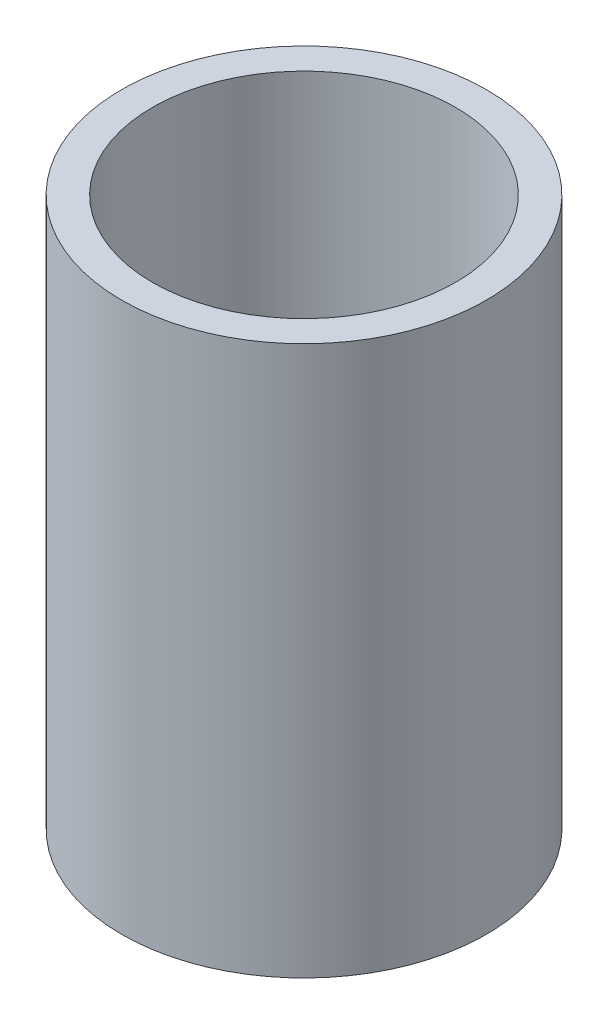
ISO-10303-21;
HEADER;
FILE_DESCRIPTION(('STEP AP214'),'2;1');
FILE_NAME('part.step','',(''),(''),'','','');
FILE_SCHEMA(('AUTOMOTIVE_DESIGN { 1 0 10303 214 1 1 1 1 }'));
ENDSEC;
DATA;
#1=APPLICATION_CONTEXT('core data for automotive mechanical design processes');
#2=APPLICATION_PROTOCOL_DEFINITION('international standard','automotive_design',2000,#1);
#3=PRODUCT_CONTEXT('',#1,'mechanical');
#4=PRODUCT('Part','Part','',(#3));
#5=PRODUCT_RELATED_PRODUCT_CATEGORY('part','',(#4));
#6=PRODUCT_DEFINITION_FORMATION('','',#4);
#7=PRODUCT_DEFINITION_CONTEXT('part definition',#1,'design');
#8=PRODUCT_DEFINITION('design','',#6,#7);
#9=PRODUCT_DEFINITION_SHAPE('','',#8);
#10=(LENGTH_UNIT() NAMED_UNIT(*) SI_UNIT(.MILLI.,.METRE.));
#11=(NAMED_UNIT(*) PLANE_ANGLE_UNIT() SI_UNIT($,.RADIAN.));
#12=(NAMED_UNIT(*) SI_UNIT($,.STERADIAN.) SOLID_ANGLE_UNIT());
#13=UNCERTAINTY_MEASURE_WITH_UNIT(LENGTH_MEASURE(1.E-05),#10,'distance_accuracy_value','');
#14=(GEOMETRIC_REPRESENTATION_CONTEXT(3) GLOBAL_UNCERTAINTY_ASSIGNED_CONTEXT((#13)) GLOBAL_UNIT_ASSIGNED_CONTEXT((#10,
#11,#12)) REPRESENTATION_CONTEXT('',''));
#15=CARTESIAN_POINT('',(0.,0.,0.));
#16=DIRECTION('',(0.,0.,1.));
#17=DIRECTION('',(1.,0.,0.));
#18=AXIS2_PLACEMENT_3D('',#15,#16,#17);
#19=CARTESIAN_POINT('',(0.,-31.75,0.));
#20=DIRECTION('',(0.,1.,0.));
#21=DIRECTION('',(0.,0.,1.));
#22=AXIS2_PLACEMENT_3D('',#19,#20,#21);
#23=CYLINDRICAL_SURFACE('',#22,17.526);
#24=CARTESIAN_POINT('',(0.,31.75,0.));
#25=DIRECTION('',(0.,1.,0.));
#26=DIRECTION('',(0.,0.,1.));
#27=AXIS2_PLACEMENT_3D('',#24,#25,#26);
#28=CIRCLE('',#27,17.526);
#29=CARTESIAN_POINT('',(0.,31.75,17.526));
#30=VERTEX_POINT('',#29);
#31=EDGE_CURVE('E17',#30,#30,#28,.F.);
#32=ORIENTED_EDGE('',*,*,#31,.F.);
#33=EDGE_LOOP('',(#32));
#34=FACE_BOUND('',#33,.T.);
#35=CARTESIAN_POINT('',(0.,-31.75,0.));
#36=DIRECTION('',(0.,1.,0.));
#37=DIRECTION('',(0.,0.,1.));
#38=AXIS2_PLACEMENT_3D('',#35,#36,#37);
#39=CIRCLE('',#38,17.526);
#40=CARTESIAN_POINT('',(0.,-31.75,17.526));
#41=VERTEX_POINT('',#40);
#42=EDGE_CURVE('E26',#41,#41,#39,.F.);
#43=ORIENTED_EDGE('',*,*,#42,.T.);
#44=EDGE_LOOP('',(#43));
#45=FACE_BOUND('',#44,.T.);
#46=ADVANCED_FACE('F14',(#34,#45),#23,.F.);
#47=CARTESIAN_POINT('',(0.,31.75,0.));
#48=DIRECTION('',(0.,1.,0.));
#49=DIRECTION('',(0.,0.,1.));
#50=AXIS2_PLACEMENT_3D('',#47,#48,#49);
#51=PLANE('',#50);
#52=ORIENTED_EDGE('',*,*,#31,.T.);
#53=EDGE_LOOP('',(#52));
#54=FACE_BOUND('',#53,.T.);
#55=CARTESIAN_POINT('',(0.,31.75,0.));
#56=DIRECTION('',(0.,1.,0.));
#57=DIRECTION('',(0.,0.,1.));
#58=AXIS2_PLACEMENT_3D('',#55,#56,#57);
#59=CIRCLE('',#58,21.082);
#60=CARTESIAN_POINT('',(0.,31.75,21.082));
#61=VERTEX_POINT('',#60);
#62=EDGE_CURVE('E21',#61,#61,#59,.F.);
#63=ORIENTED_EDGE('',*,*,#62,.F.);
#64=EDGE_LOOP('',(#63));
#65=FACE_BOUND('',#64,.T.);
#66=ADVANCED_FACE('F34',(#54,#65),#51,.T.);
#67=CARTESIAN_POINT('',(0.,-31.75,0.));
#68=DIRECTION('',(0.,1.,0.));
#69=DIRECTION('',(0.,0.,1.));
#70=AXIS2_PLACEMENT_3D('',#67,#68,#69);
#71=PLANE('',#70);
#72=ORIENTED_EDGE('',*,*,#42,.F.);
#73=EDGE_LOOP('',(#72));
#74=FACE_BOUND('',#73,.T.);
#75=CARTESIAN_POINT('',(0.,-31.75,0.));
#76=DIRECTION('',(0.,1.,0.));
#77=DIRECTION('',(0.,0.,1.));
#78=AXIS2_PLACEMENT_3D('',#75,#76,#77);
#79=CIRCLE('',#78,21.082);
#80=CARTESIAN_POINT('',(0.,-31.75,21.082));
#81=VERTEX_POINT('',#80);
#82=EDGE_CURVE('E10',#81,#81,#79,.T.);
#83=ORIENTED_EDGE('',*,*,#82,.F.);
#84=EDGE_LOOP('',(#83));
#85=FACE_BOUND('',#84,.T.);
#86=ADVANCED_FACE('F42',(#74,#85),#71,.F.);
#87=CARTESIAN_POINT('',(0.,-31.75,0.));
#88=DIRECTION('',(0.,1.,0.));
#89=DIRECTION('',(0.,0.,1.));
#90=AXIS2_PLACEMENT_3D('',#87,#88,#89);
#91=CYLINDRICAL_SURFACE('',#90,21.082);
#92=ORIENTED_EDGE('',*,*,#62,.T.);
#93=EDGE_LOOP('',(#92));
#94=FACE_BOUND('',#93,.T.);
#95=ORIENTED_EDGE('',*,*,#82,.T.);
#96=EDGE_LOOP('',(#95));
#97=FACE_BOUND('',#96,.T.);
#98=ADVANCED_FACE('F43',(#94,#97),#91,.T.);
#99=CLOSED_SHELL('',(#46,#66,#86,#98));
#100=MANIFOLD_SOLID_BREP('B1',#99);
#101=ADVANCED_BREP_SHAPE_REPRESENTATION('',(#18,#100),#14);
#102=SHAPE_DEFINITION_REPRESENTATION(#9,#101);
ENDSEC;
END-ISO-10303-21;
